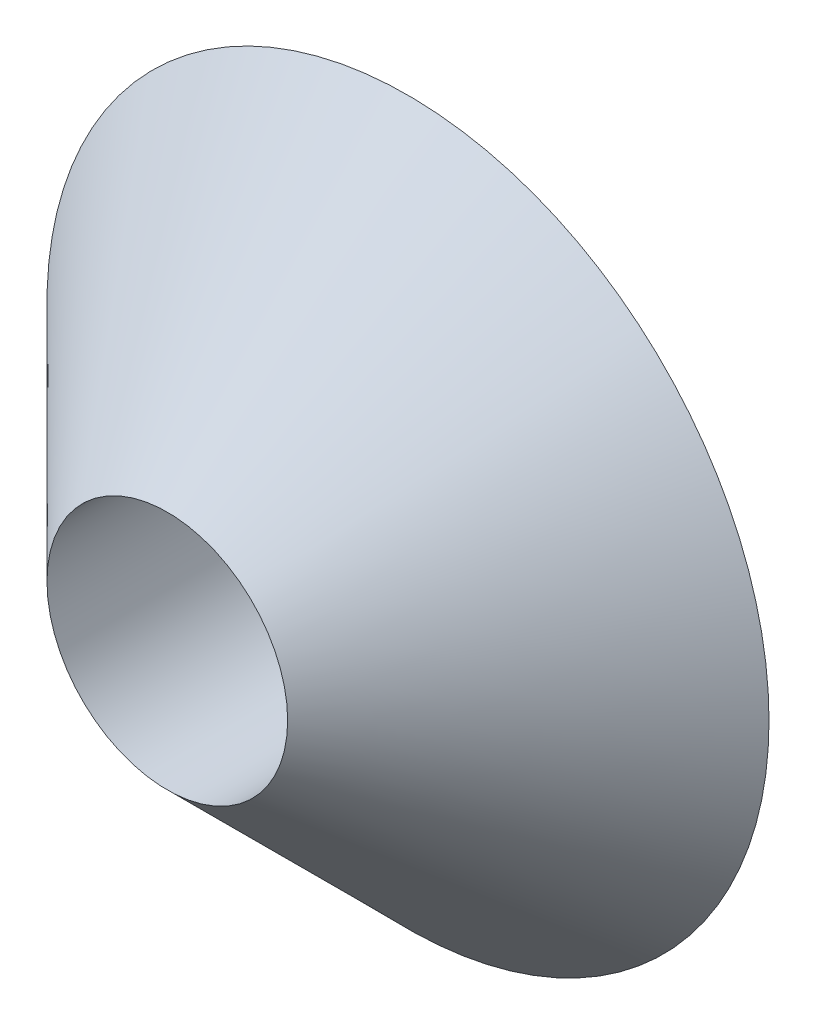
ISO-10303-21;
HEADER;
FILE_DESCRIPTION(('STEP AP214'),'2;1');
FILE_NAME('part.step','',(''),(''),'','','');
FILE_SCHEMA(('AUTOMOTIVE_DESIGN { 1 0 10303 214 1 1 1 1 }'));
ENDSEC;
DATA;
#1=APPLICATION_CONTEXT('core data for automotive mechanical design processes');
#2=APPLICATION_PROTOCOL_DEFINITION('international standard','automotive_design',2000,#1);
#3=PRODUCT_CONTEXT('',#1,'mechanical');
#4=PRODUCT('Part','Part','',(#3));
#5=PRODUCT_RELATED_PRODUCT_CATEGORY('part','',(#4));
#6=PRODUCT_DEFINITION_FORMATION('','',#4);
#7=PRODUCT_DEFINITION_CONTEXT('part definition',#1,'design');
#8=PRODUCT_DEFINITION('design','',#6,#7);
#9=PRODUCT_DEFINITION_SHAPE('','',#8);
#10=(LENGTH_UNIT() NAMED_UNIT(*) SI_UNIT(.MILLI.,.METRE.));
#11=(NAMED_UNIT(*) PLANE_ANGLE_UNIT() SI_UNIT($,.RADIAN.));
#12=(NAMED_UNIT(*) SI_UNIT($,.STERADIAN.) SOLID_ANGLE_UNIT());
#13=UNCERTAINTY_MEASURE_WITH_UNIT(LENGTH_MEASURE(1.E-05),#10,'distance_accuracy_value','');
#14=(GEOMETRIC_REPRESENTATION_CONTEXT(3) GLOBAL_UNCERTAINTY_ASSIGNED_CONTEXT((#13)) GLOBAL_UNIT_ASSIGNED_CONTEXT((#10,
#11,#12)) REPRESENTATION_CONTEXT('',''));
#15=CARTESIAN_POINT('',(0.,0.,0.));
#16=DIRECTION('',(0.,0.,1.));
#17=DIRECTION('',(1.,0.,0.));
#18=AXIS2_PLACEMENT_3D('',#15,#16,#17);
#19=CARTESIAN_POINT('',(0.,0.,-9.99999999999999));
#20=DIRECTION('',(0.,0.,1.));
#21=DIRECTION('',(1.,0.,0.));
#22=AXIS2_PLACEMENT_3D('',#19,#20,#21);
#23=PLANE('',#22);
#24=CARTESIAN_POINT('',(0.,0.,-9.99999999999999));
#25=DIRECTION('',(0.,0.,1.));
#26=DIRECTION('',(1.,0.,0.));
#27=AXIS2_PLACEMENT_3D('',#24,#25,#26);
#28=CIRCLE('',#27,5.);
#29=CARTESIAN_POINT('',(5.,0.,-9.99999999999999));
#30=VERTEX_POINT('',#29);
#31=EDGE_CURVE('E36',#30,#30,#28,.T.);
#32=ORIENTED_EDGE('',*,*,#31,.T.);
#33=EDGE_LOOP('',(#32));
#34=FACE_BOUND('',#33,.T.);
#35=CARTESIAN_POINT('',(0.,0.,-9.99999999999999));
#36=DIRECTION('',(0.,0.,1.));
#37=DIRECTION('',(1.,0.,0.));
#38=AXIS2_PLACEMENT_3D('',#35,#36,#37);
#39=CIRCLE('',#38,15.);
#40=CARTESIAN_POINT('',(15.,0.,-9.99999999999999));
#41=VERTEX_POINT('',#40);
#42=EDGE_CURVE('E10',#41,#41,#39,.T.);
#43=ORIENTED_EDGE('',*,*,#42,.F.);
#44=EDGE_LOOP('',(#43));
#45=FACE_BOUND('',#44,.T.);
#46=ADVANCED_FACE('F30',(#34,#45),#23,.F.);
#47=CARTESIAN_POINT('',(0.,0.,-9.99999999999999));
#48=DIRECTION('',(0.,0.,-1.));
#49=DIRECTION('',(-1.,0.,0.));
#50=AXIS2_PLACEMENT_3D('',#47,#48,#49);
#51=CONICAL_SURFACE('',#50,15.,0.785398163397449);
#52=CARTESIAN_POINT('',(0.,0.,0.));
#53=DIRECTION('',(0.,0.,1.));
#54=DIRECTION('',(1.,0.,0.));
#55=AXIS2_PLACEMENT_3D('',#52,#53,#54);
#56=CIRCLE('',#55,5.);
#57=CARTESIAN_POINT('',(5.,0.,0.));
#58=VERTEX_POINT('',#57);
#59=EDGE_CURVE('E40',#58,#58,#56,.T.);
#60=ORIENTED_EDGE('',*,*,#59,.F.);
#61=EDGE_LOOP('',(#60));
#62=FACE_BOUND('',#61,.T.);
#63=ORIENTED_EDGE('',*,*,#42,.T.);
#64=EDGE_LOOP('',(#63));
#65=FACE_BOUND('',#64,.T.);
#66=ADVANCED_FACE('F49',(#62,#65),#51,.T.);
#67=CARTESIAN_POINT('',(0.,0.,-9.99999999999999));
#68=DIRECTION('',(0.,0.,1.));
#69=DIRECTION('',(1.,0.,0.));
#70=AXIS2_PLACEMENT_3D('',#67,#68,#69);
#71=CYLINDRICAL_SURFACE('',#70,5.);
#72=ORIENTED_EDGE('',*,*,#31,.F.);
#73=EDGE_LOOP('',(#72));
#74=FACE_BOUND('',#73,.T.);
#75=ORIENTED_EDGE('',*,*,#59,.T.);
#76=EDGE_LOOP('',(#75));
#77=FACE_BOUND('',#76,.T.);
#78=ADVANCED_FACE('F47',(#74,#77),#71,.F.);
#79=CLOSED_SHELL('',(#46,#66,#78));
#80=MANIFOLD_SOLID_BREP('B2',#79);
#81=ADVANCED_BREP_SHAPE_REPRESENTATION('',(#18,#80),#14);
#82=SHAPE_DEFINITION_REPRESENTATION(#9,#81);
ENDSEC;
END-ISO-10303-21;
